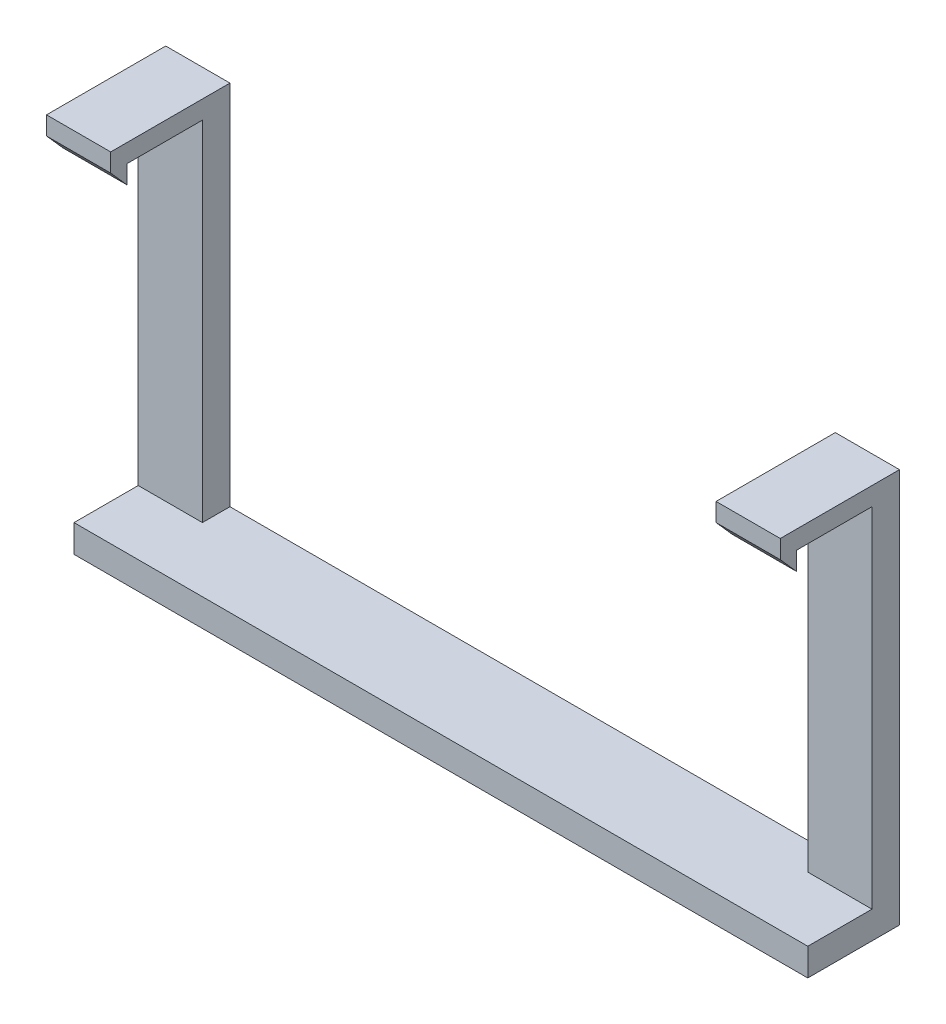
ISO-10303-21;
HEADER;
FILE_DESCRIPTION(('STEP AP214'),'2;1');
FILE_NAME('part.step','',(''),(''),'','','');
FILE_SCHEMA(('AUTOMOTIVE_DESIGN { 1 0 10303 214 1 1 1 1 }'));
ENDSEC;
DATA;
#1=APPLICATION_CONTEXT('core data for automotive mechanical design processes');
#2=APPLICATION_PROTOCOL_DEFINITION('international standard','automotive_design',2000,#1);
#3=PRODUCT_CONTEXT('',#1,'mechanical');
#4=PRODUCT('Part','Part','',(#3));
#5=PRODUCT_RELATED_PRODUCT_CATEGORY('part','',(#4));
#6=PRODUCT_DEFINITION_FORMATION('','',#4);
#7=PRODUCT_DEFINITION_CONTEXT('part definition',#1,'design');
#8=PRODUCT_DEFINITION('design','',#6,#7);
#9=PRODUCT_DEFINITION_SHAPE('','',#8);
#10=(LENGTH_UNIT() NAMED_UNIT(*) SI_UNIT(.MILLI.,.METRE.));
#11=(NAMED_UNIT(*) PLANE_ANGLE_UNIT() SI_UNIT($,.RADIAN.));
#12=(NAMED_UNIT(*) SI_UNIT($,.STERADIAN.) SOLID_ANGLE_UNIT());
#13=UNCERTAINTY_MEASURE_WITH_UNIT(LENGTH_MEASURE(1.E-05),#10,'distance_accuracy_value','');
#14=(GEOMETRIC_REPRESENTATION_CONTEXT(3) GLOBAL_UNCERTAINTY_ASSIGNED_CONTEXT((#13)) GLOBAL_UNIT_ASSIGNED_CONTEXT((#10,
#11,#12)) REPRESENTATION_CONTEXT('',''));
#15=CARTESIAN_POINT('',(0.,0.,0.));
#16=DIRECTION('',(0.,0.,1.));
#17=DIRECTION('',(1.,0.,0.));
#18=AXIS2_PLACEMENT_3D('',#15,#16,#17);
#19=CARTESIAN_POINT('',(0.,0.,13.));
#20=DIRECTION('',(0.,1.,0.));
#21=DIRECTION('',(0.,0.,1.));
#22=AXIS2_PLACEMENT_3D('',#19,#20,#21);
#23=PLANE('',#22);
#24=DIRECTION('',(1.,0.,0.));
#25=VECTOR('',#24,1.);
#26=CARTESIAN_POINT('',(-60.0000000000001,0.,10.));
#27=LINE('',#26,#25);
#28=CARTESIAN_POINT('',(-40.,0.,10.));
#29=VERTEX_POINT('',#28);
#30=CARTESIAN_POINT('',(40.,0.,10.));
#31=VERTEX_POINT('',#30);
#32=EDGE_CURVE('E181',#29,#31,#27,.T.);
#33=ORIENTED_EDGE('',*,*,#32,.F.);
#34=DIRECTION('',(0.,0.,-1.));
#35=VECTOR('',#34,1.);
#36=CARTESIAN_POINT('',(-40.,0.,13.));
#37=LINE('',#36,#35);
#38=CARTESIAN_POINT('',(-40.,0.,0.));
#39=VERTEX_POINT('',#38);
#40=EDGE_CURVE('E221',#29,#39,#37,.T.);
#41=ORIENTED_EDGE('',*,*,#40,.T.);
#42=DIRECTION('',(1.,0.,0.));
#43=VECTOR('',#42,1.);
#44=CARTESIAN_POINT('',(0.,0.,0.));
#45=LINE('',#44,#43);
#46=CARTESIAN_POINT('',(40.,0.,0.));
#47=VERTEX_POINT('',#46);
#48=EDGE_CURVE('E189',#39,#47,#45,.T.);
#49=ORIENTED_EDGE('',*,*,#48,.T.);
#50=DIRECTION('',(0.,0.,-1.));
#51=VECTOR('',#50,1.);
#52=CARTESIAN_POINT('',(40.,0.,13.));
#53=LINE('',#52,#51);
#54=EDGE_CURVE('E131',#31,#47,#53,.T.);
#55=ORIENTED_EDGE('',*,*,#54,.F.);
#56=EDGE_LOOP('',(#33,#41,#49,#55));
#57=FACE_BOUND('',#56,.T.);
#58=ADVANCED_FACE('F39',(#57),#23,.F.);
#59=CARTESIAN_POINT('',(40.,0.,13.));
#60=DIRECTION('',(-1.,0.,0.));
#61=DIRECTION('',(0.,0.,1.));
#62=AXIS2_PLACEMENT_3D('',#59,#60,#61);
#63=PLANE('',#62);
#64=DIRECTION('',(0.,-1.,0.));
#65=VECTOR('',#64,1.);
#66=CARTESIAN_POINT('',(40.,0.,10.));
#67=LINE('',#66,#65);
#68=CARTESIAN_POINT('',(40.,3.,10.));
#69=VERTEX_POINT('',#68);
#70=EDGE_CURVE('E216',#69,#31,#67,.T.);
#71=ORIENTED_EDGE('',*,*,#70,.T.);
#72=ORIENTED_EDGE('',*,*,#54,.T.);
#73=DIRECTION('',(0.,1.,0.));
#74=VECTOR('',#73,1.);
#75=CARTESIAN_POINT('',(40.,0.,0.));
#76=LINE('',#75,#74);
#77=CARTESIAN_POINT('',(40.,43.,0.));
#78=VERTEX_POINT('',#77);
#79=EDGE_CURVE('E198',#47,#78,#76,.T.);
#80=ORIENTED_EDGE('',*,*,#79,.T.);
#81=DIRECTION('',(0.,0.,-1.));
#82=VECTOR('',#81,1.);
#83=CARTESIAN_POINT('',(40.,43.,13.));
#84=LINE('',#83,#82);
#85=CARTESIAN_POINT('',(40.,43.,13.));
#86=VERTEX_POINT('',#85);
#87=EDGE_CURVE('E127',#86,#78,#84,.T.);
#88=ORIENTED_EDGE('',*,*,#87,.F.);
#89=DIRECTION('',(0.,1.,0.));
#90=VECTOR('',#89,1.);
#91=CARTESIAN_POINT('',(40.,0.,13.));
#92=LINE('',#91,#90);
#93=CARTESIAN_POINT('',(40.,41.,13.));
#94=VERTEX_POINT('',#93);
#95=EDGE_CURVE('E119',#94,#86,#92,.T.);
#96=ORIENTED_EDGE('',*,*,#95,.F.);
#97=DIRECTION('',(0.,0.748415259125279,0.663230427459749));
#98=VECTOR('',#97,1.);
#99=CARTESIAN_POINT('',(40.,11.5820255572943,-13.0696124601191));
#100=LINE('',#99,#98);
#101=CARTESIAN_POINT('',(40.,39.0020320624936,11.2294413254053));
#102=VERTEX_POINT('',#101);
#103=EDGE_CURVE('E54',#102,#94,#100,.T.);
#104=ORIENTED_EDGE('',*,*,#103,.F.);
#105=DIRECTION('',(0.,-1.,0.));
#106=VECTOR('',#105,1.);
#107=CARTESIAN_POINT('',(40.,0.,11.2294413254053));
#108=LINE('',#107,#106);
#109=CARTESIAN_POINT('',(40.,41.0020320624936,11.2294413254053));
#110=VERTEX_POINT('',#109);
#111=EDGE_CURVE('E250',#110,#102,#108,.T.);
#112=ORIENTED_EDGE('',*,*,#111,.F.);
#113=DIRECTION('',(0.,0.,-1.));
#114=VECTOR('',#113,1.);
#115=CARTESIAN_POINT('',(40.,41.0020320624936,0.));
#116=LINE('',#115,#114);
#117=CARTESIAN_POINT('',(40.,41.0020320624936,3.));
#118=VERTEX_POINT('',#117);
#119=EDGE_CURVE('E166',#110,#118,#116,.T.);
#120=ORIENTED_EDGE('',*,*,#119,.T.);
#121=DIRECTION('',(0.,-1.,0.));
#122=VECTOR('',#121,1.);
#123=CARTESIAN_POINT('',(40.,0.,2.99999999999999));
#124=LINE('',#123,#122);
#125=CARTESIAN_POINT('',(40.,3.,3.));
#126=VERTEX_POINT('',#125);
#127=EDGE_CURVE('E259',#118,#126,#124,.T.);
#128=ORIENTED_EDGE('',*,*,#127,.T.);
#129=DIRECTION('',(0.,0.,1.));
#130=VECTOR('',#129,1.);
#131=CARTESIAN_POINT('',(40.,3.,0.));
#132=LINE('',#131,#130);
#133=EDGE_CURVE('E257',#126,#69,#132,.T.);
#134=ORIENTED_EDGE('',*,*,#133,.T.);
#135=EDGE_LOOP('',(#71,#72,#80,#88,#96,#104,#112,#120,#128,#134));
#136=FACE_BOUND('',#135,.T.);
#137=ADVANCED_FACE('F210',(#136),#63,.F.);
#138=CARTESIAN_POINT('',(33.,3.,13.));
#139=DIRECTION('',(1.,0.,0.));
#140=DIRECTION('',(0.,0.,-1.));
#141=AXIS2_PLACEMENT_3D('',#138,#139,#140);
#142=PLANE('',#141);
#143=DIRECTION('',(0.,-1.,0.));
#144=VECTOR('',#143,1.);
#145=CARTESIAN_POINT('',(33.,3.,2.99999999999999));
#146=LINE('',#145,#144);
#147=CARTESIAN_POINT('',(33.,41.0020320624936,3.));
#148=VERTEX_POINT('',#147);
#149=CARTESIAN_POINT('',(33.,3.,3.));
#150=VERTEX_POINT('',#149);
#151=EDGE_CURVE('E173',#148,#150,#146,.T.);
#152=ORIENTED_EDGE('',*,*,#151,.F.);
#153=DIRECTION('',(0.,0.,-1.));
#154=VECTOR('',#153,1.);
#155=CARTESIAN_POINT('',(33.,41.0020320624936,13.));
#156=LINE('',#155,#154);
#157=CARTESIAN_POINT('',(33.,41.0020320624936,11.2294413254053));
#158=VERTEX_POINT('',#157);
#159=EDGE_CURVE('E11',#158,#148,#156,.T.);
#160=ORIENTED_EDGE('',*,*,#159,.F.);
#161=DIRECTION('',(0.,-1.,0.));
#162=VECTOR('',#161,1.);
#163=CARTESIAN_POINT('',(33.,3.,11.2294413254053));
#164=LINE('',#163,#162);
#165=CARTESIAN_POINT('',(33.,39.0020320624936,11.2294413254053));
#166=VERTEX_POINT('',#165);
#167=EDGE_CURVE('E47',#158,#166,#164,.T.);
#168=ORIENTED_EDGE('',*,*,#167,.T.);
#169=DIRECTION('',(0.,0.748415259125279,0.663230427459749));
#170=VECTOR('',#169,1.);
#171=CARTESIAN_POINT('',(33.,19.7152347965208,-5.86212734462819));
#172=LINE('',#171,#170);
#173=CARTESIAN_POINT('',(33.,41.,13.));
#174=VERTEX_POINT('',#173);
#175=EDGE_CURVE('E148',#166,#174,#172,.T.);
#176=ORIENTED_EDGE('',*,*,#175,.T.);
#177=DIRECTION('',(0.,-1.,0.));
#178=VECTOR('',#177,1.);
#179=CARTESIAN_POINT('',(33.,3.,13.));
#180=LINE('',#179,#178);
#181=CARTESIAN_POINT('',(33.,43.,13.));
#182=VERTEX_POINT('',#181);
#183=EDGE_CURVE('E100',#182,#174,#180,.T.);
#184=ORIENTED_EDGE('',*,*,#183,.F.);
#185=DIRECTION('',(0.,0.,-1.));
#186=VECTOR('',#185,1.);
#187=CARTESIAN_POINT('',(33.,43.,13.));
#188=LINE('',#187,#186);
#189=CARTESIAN_POINT('',(33.,43.,0.));
#190=VERTEX_POINT('',#189);
#191=EDGE_CURVE('E99',#182,#190,#188,.T.);
#192=ORIENTED_EDGE('',*,*,#191,.T.);
#193=DIRECTION('',(0.,-1.,0.));
#194=VECTOR('',#193,1.);
#195=CARTESIAN_POINT('',(33.,3.,0.));
#196=LINE('',#195,#194);
#197=CARTESIAN_POINT('',(33.,3.,0.));
#198=VERTEX_POINT('',#197);
#199=EDGE_CURVE('E104',#190,#198,#196,.T.);
#200=ORIENTED_EDGE('',*,*,#199,.T.);
#201=DIRECTION('',(0.,0.,-1.));
#202=VECTOR('',#201,1.);
#203=CARTESIAN_POINT('',(33.,3.,13.));
#204=LINE('',#203,#202);
#205=EDGE_CURVE('E83',#150,#198,#204,.T.);
#206=ORIENTED_EDGE('',*,*,#205,.F.);
#207=EDGE_LOOP('',(#152,#160,#168,#176,#184,#192,#200,#206));
#208=FACE_BOUND('',#207,.T.);
#209=ADVANCED_FACE('F105',(#208),#142,.F.);
#210=CARTESIAN_POINT('',(0.,3.,13.));
#211=DIRECTION('',(0.,-1.,0.));
#212=DIRECTION('',(0.,0.,-1.));
#213=AXIS2_PLACEMENT_3D('',#210,#211,#212);
#214=PLANE('',#213);
#215=DIRECTION('',(-1.,0.,0.));
#216=VECTOR('',#215,1.);
#217=CARTESIAN_POINT('',(0.,3.,10.));
#218=LINE('',#217,#216);
#219=CARTESIAN_POINT('',(-40.,3.,10.));
#220=VERTEX_POINT('',#219);
#221=EDGE_CURVE('E137',#69,#220,#218,.T.);
#222=ORIENTED_EDGE('',*,*,#221,.F.);
#223=ORIENTED_EDGE('',*,*,#133,.F.);
#224=DIRECTION('',(1.,0.,0.));
#225=VECTOR('',#224,1.);
#226=CARTESIAN_POINT('',(-60.0000000000001,3.,3.));
#227=LINE('',#226,#225);
#228=EDGE_CURVE('E95',#150,#126,#227,.T.);
#229=ORIENTED_EDGE('',*,*,#228,.F.);
#230=ORIENTED_EDGE('',*,*,#205,.T.);
#231=DIRECTION('',(-1.,0.,0.));
#232=VECTOR('',#231,1.);
#233=CARTESIAN_POINT('',(0.,3.,0.));
#234=LINE('',#233,#232);
#235=CARTESIAN_POINT('',(-33.,3.,0.));
#236=VERTEX_POINT('',#235);
#237=EDGE_CURVE('E90',#198,#236,#234,.T.);
#238=ORIENTED_EDGE('',*,*,#237,.T.);
#239=DIRECTION('',(0.,0.,-1.));
#240=VECTOR('',#239,1.);
#241=CARTESIAN_POINT('',(-33.,3.,13.));
#242=LINE('',#241,#240);
#243=CARTESIAN_POINT('',(-33.,3.,3.));
#244=VERTEX_POINT('',#243);
#245=EDGE_CURVE('E389',#244,#236,#242,.T.);
#246=ORIENTED_EDGE('',*,*,#245,.F.);
#247=DIRECTION('',(-1.,0.,0.));
#248=VECTOR('',#247,1.);
#249=CARTESIAN_POINT('',(60.0000000000001,3.,3.));
#250=LINE('',#249,#248);
#251=CARTESIAN_POINT('',(-40.,3.,3.));
#252=VERTEX_POINT('',#251);
#253=EDGE_CURVE('E335',#244,#252,#250,.T.);
#254=ORIENTED_EDGE('',*,*,#253,.T.);
#255=DIRECTION('',(0.,0.,1.));
#256=VECTOR('',#255,1.);
#257=CARTESIAN_POINT('',(-40.,3.,0.));
#258=LINE('',#257,#256);
#259=EDGE_CURVE('E354',#252,#220,#258,.T.);
#260=ORIENTED_EDGE('',*,*,#259,.T.);
#261=EDGE_LOOP('',(#222,#223,#229,#230,#238,#246,#254,#260));
#262=FACE_BOUND('',#261,.T.);
#263=ADVANCED_FACE('F86',(#262),#214,.F.);
#264=CARTESIAN_POINT('',(33.,43.,13.));
#265=DIRECTION('',(0.,-1.,0.));
#266=DIRECTION('',(0.,0.,-1.));
#267=AXIS2_PLACEMENT_3D('',#264,#265,#266);
#268=PLANE('',#267);
#269=DIRECTION('',(-1.,0.,0.));
#270=VECTOR('',#269,1.);
#271=CARTESIAN_POINT('',(33.,43.,0.));
#272=LINE('',#271,#270);
#273=EDGE_CURVE('E110',#78,#190,#272,.T.);
#274=ORIENTED_EDGE('',*,*,#273,.T.);
#275=ORIENTED_EDGE('',*,*,#191,.F.);
#276=DIRECTION('',(-1.,0.,0.));
#277=VECTOR('',#276,1.);
#278=CARTESIAN_POINT('',(33.,43.,13.));
#279=LINE('',#278,#277);
#280=EDGE_CURVE('E63',#86,#182,#279,.T.);
#281=ORIENTED_EDGE('',*,*,#280,.F.);
#282=ORIENTED_EDGE('',*,*,#87,.T.);
#283=EDGE_LOOP('',(#274,#275,#281,#282));
#284=FACE_BOUND('',#283,.T.);
#285=ADVANCED_FACE('F202',(#284),#268,.F.);
#286=CARTESIAN_POINT('',(0.,0.,13.));
#287=DIRECTION('',(0.,0.,-1.));
#288=DIRECTION('',(-1.,0.,0.));
#289=AXIS2_PLACEMENT_3D('',#286,#287,#288);
#290=PLANE('',#289);
#291=ORIENTED_EDGE('',*,*,#183,.T.);
#292=DIRECTION('',(1.,0.,0.));
#293=VECTOR('',#292,1.);
#294=CARTESIAN_POINT('',(0.,41.,13.));
#295=LINE('',#294,#293);
#296=EDGE_CURVE('E134',#174,#94,#295,.T.);
#297=ORIENTED_EDGE('',*,*,#296,.T.);
#298=ORIENTED_EDGE('',*,*,#95,.T.);
#299=ORIENTED_EDGE('',*,*,#280,.T.);
#300=EDGE_LOOP('',(#291,#297,#298,#299));
#301=FACE_BOUND('',#300,.T.);
#302=ADVANCED_FACE('F432',(#301),#290,.F.);
#303=CARTESIAN_POINT('',(0.,0.,0.));
#304=DIRECTION('',(0.,0.,-1.));
#305=DIRECTION('',(-1.,0.,0.));
#306=AXIS2_PLACEMENT_3D('',#303,#304,#305);
#307=PLANE('',#306);
#308=ORIENTED_EDGE('',*,*,#48,.F.);
#309=DIRECTION('',(0.,1.,0.));
#310=VECTOR('',#309,1.);
#311=CARTESIAN_POINT('',(-40.,0.,0.));
#312=LINE('',#311,#310);
#313=CARTESIAN_POINT('',(-40.,43.,0.));
#314=VERTEX_POINT('',#313);
#315=EDGE_CURVE('E378',#39,#314,#312,.T.);
#316=ORIENTED_EDGE('',*,*,#315,.T.);
#317=DIRECTION('',(1.,0.,0.));
#318=VECTOR('',#317,1.);
#319=CARTESIAN_POINT('',(-33.,43.,0.));
#320=LINE('',#319,#318);
#321=CARTESIAN_POINT('',(-33.,43.,0.));
#322=VERTEX_POINT('',#321);
#323=EDGE_CURVE('E392',#314,#322,#320,.T.);
#324=ORIENTED_EDGE('',*,*,#323,.T.);
#325=DIRECTION('',(0.,-1.,0.));
#326=VECTOR('',#325,1.);
#327=CARTESIAN_POINT('',(-33.,3.,0.));
#328=LINE('',#327,#326);
#329=EDGE_CURVE('E116',#322,#236,#328,.T.);
#330=ORIENTED_EDGE('',*,*,#329,.T.);
#331=ORIENTED_EDGE('',*,*,#237,.F.);
#332=ORIENTED_EDGE('',*,*,#199,.F.);
#333=ORIENTED_EDGE('',*,*,#273,.F.);
#334=ORIENTED_EDGE('',*,*,#79,.F.);
#335=EDGE_LOOP('',(#308,#316,#324,#330,#331,#332,#333,#334));
#336=FACE_BOUND('',#335,.T.);
#337=ADVANCED_FACE('F113',(#336),#307,.T.);
#338=CARTESIAN_POINT('',(-60.0000000000001,0.,11.2294413254053));
#339=DIRECTION('',(0.,0.,1.));
#340=DIRECTION('',(1.,0.,0.));
#341=AXIS2_PLACEMENT_3D('',#338,#339,#340);
#342=PLANE('',#341);
#343=DIRECTION('',(1.,0.,0.));
#344=VECTOR('',#343,1.);
#345=CARTESIAN_POINT('',(-60.0000000000001,41.0020320624936,11.2294413254053));
#346=LINE('',#345,#344);
#347=EDGE_CURVE('E157',#158,#110,#346,.T.);
#348=ORIENTED_EDGE('',*,*,#347,.T.);
#349=ORIENTED_EDGE('',*,*,#111,.T.);
#350=DIRECTION('',(1.,0.,0.));
#351=VECTOR('',#350,1.);
#352=CARTESIAN_POINT('',(-60.0000000000001,39.0020320624936,11.2294413254053));
#353=LINE('',#352,#351);
#354=EDGE_CURVE('E159',#166,#102,#353,.T.);
#355=ORIENTED_EDGE('',*,*,#354,.F.);
#356=ORIENTED_EDGE('',*,*,#167,.F.);
#357=EDGE_LOOP('',(#348,#349,#355,#356));
#358=FACE_BOUND('',#357,.T.);
#359=ADVANCED_FACE('F155',(#358),#342,.F.);
#360=CARTESIAN_POINT('',(-60.0000000000001,41.0020320624936,0.));
#361=DIRECTION('',(0.,-1.,0.));
#362=DIRECTION('',(0.,0.,-1.));
#363=AXIS2_PLACEMENT_3D('',#360,#361,#362);
#364=PLANE('',#363);
#365=ORIENTED_EDGE('',*,*,#159,.T.);
#366=DIRECTION('',(1.,0.,0.));
#367=VECTOR('',#366,1.);
#368=CARTESIAN_POINT('',(-60.0000000000001,41.0020320624936,3.));
#369=LINE('',#368,#367);
#370=EDGE_CURVE('E169',#148,#118,#369,.T.);
#371=ORIENTED_EDGE('',*,*,#370,.T.);
#372=ORIENTED_EDGE('',*,*,#119,.F.);
#373=ORIENTED_EDGE('',*,*,#347,.F.);
#374=EDGE_LOOP('',(#365,#371,#372,#373));
#375=FACE_BOUND('',#374,.T.);
#376=ADVANCED_FACE('F162',(#375),#364,.T.);
#377=CARTESIAN_POINT('',(-60.0000000000001,0.,2.99999999999999));
#378=DIRECTION('',(0.,0.,1.));
#379=DIRECTION('',(0.,-1.,0.));
#380=AXIS2_PLACEMENT_3D('',#377,#378,#379);
#381=PLANE('',#380);
#382=ORIENTED_EDGE('',*,*,#151,.T.);
#383=ORIENTED_EDGE('',*,*,#228,.T.);
#384=ORIENTED_EDGE('',*,*,#127,.F.);
#385=ORIENTED_EDGE('',*,*,#370,.F.);
#386=EDGE_LOOP('',(#382,#383,#384,#385));
#387=FACE_BOUND('',#386,.T.);
#388=ADVANCED_FACE('F275',(#387),#381,.T.);
#389=CARTESIAN_POINT('',(-60.0000000000001,0.,10.));
#390=DIRECTION('',(0.,0.,1.));
#391=DIRECTION('',(1.,0.,0.));
#392=AXIS2_PLACEMENT_3D('',#389,#390,#391);
#393=PLANE('',#392);
#394=ORIENTED_EDGE('',*,*,#221,.T.);
#395=DIRECTION('',(0.,-1.,0.));
#396=VECTOR('',#395,1.);
#397=CARTESIAN_POINT('',(-40.,0.,10.));
#398=LINE('',#397,#396);
#399=EDGE_CURVE('E344',#220,#29,#398,.T.);
#400=ORIENTED_EDGE('',*,*,#399,.T.);
#401=ORIENTED_EDGE('',*,*,#32,.T.);
#402=ORIENTED_EDGE('',*,*,#70,.F.);
#403=EDGE_LOOP('',(#394,#400,#401,#402));
#404=FACE_BOUND('',#403,.T.);
#405=ADVANCED_FACE('F412',(#404),#393,.T.);
#406=CARTESIAN_POINT('',(-60.0000000000001,11.5820255572943,-13.0696124601191));
#407=DIRECTION('',(0.,0.663230427459749,-0.748415259125279));
#408=DIRECTION('',(0.,0.748415259125279,0.663230427459749));
#409=AXIS2_PLACEMENT_3D('',#406,#407,#408);
#410=PLANE('',#409);
#411=ORIENTED_EDGE('',*,*,#354,.T.);
#412=ORIENTED_EDGE('',*,*,#103,.T.);
#413=ORIENTED_EDGE('',*,*,#296,.F.);
#414=ORIENTED_EDGE('',*,*,#175,.F.);
#415=EDGE_LOOP('',(#411,#412,#413,#414));
#416=FACE_BOUND('',#415,.T.);
#417=ADVANCED_FACE('F414',(#416),#410,.F.);
#418=CARTESIAN_POINT('',(-40.,0.,13.));
#419=DIRECTION('',(1.,0.,0.));
#420=DIRECTION('',(0.,0.,1.));
#421=AXIS2_PLACEMENT_3D('',#418,#419,#420);
#422=PLANE('',#421);
#423=ORIENTED_EDGE('',*,*,#399,.F.);
#424=ORIENTED_EDGE('',*,*,#259,.F.);
#425=DIRECTION('',(0.,-1.,0.));
#426=VECTOR('',#425,1.);
#427=CARTESIAN_POINT('',(-40.,0.,2.99999999999999));
#428=LINE('',#427,#426);
#429=CARTESIAN_POINT('',(-40.,41.0020320624936,3.));
#430=VERTEX_POINT('',#429);
#431=EDGE_CURVE('E357',#430,#252,#428,.T.);
#432=ORIENTED_EDGE('',*,*,#431,.F.);
#433=DIRECTION('',(0.,0.,-1.));
#434=VECTOR('',#433,1.);
#435=CARTESIAN_POINT('',(-40.,41.0020320624936,0.));
#436=LINE('',#435,#434);
#437=CARTESIAN_POINT('',(-40.,41.0020320624936,11.2294413254053));
#438=VERTEX_POINT('',#437);
#439=EDGE_CURVE('E336',#438,#430,#436,.T.);
#440=ORIENTED_EDGE('',*,*,#439,.F.);
#441=DIRECTION('',(0.,-1.,0.));
#442=VECTOR('',#441,1.);
#443=CARTESIAN_POINT('',(-40.,0.,11.2294413254053));
#444=LINE('',#443,#442);
#445=CARTESIAN_POINT('',(-40.,39.0020320624936,11.2294413254053));
#446=VERTEX_POINT('',#445);
#447=EDGE_CURVE('E328',#438,#446,#444,.T.);
#448=ORIENTED_EDGE('',*,*,#447,.T.);
#449=DIRECTION('',(0.,0.748415259125279,0.663230427459749));
#450=VECTOR('',#449,1.);
#451=CARTESIAN_POINT('',(-40.,11.5820255572943,-13.0696124601191));
#452=LINE('',#451,#450);
#453=CARTESIAN_POINT('',(-40.,41.,13.));
#454=VERTEX_POINT('',#453);
#455=EDGE_CURVE('E339',#446,#454,#452,.T.);
#456=ORIENTED_EDGE('',*,*,#455,.T.);
#457=DIRECTION('',(0.,1.,0.));
#458=VECTOR('',#457,1.);
#459=CARTESIAN_POINT('',(-40.,0.,13.));
#460=LINE('',#459,#458);
#461=CARTESIAN_POINT('',(-40.,43.,13.));
#462=VERTEX_POINT('',#461);
#463=EDGE_CURVE('E379',#454,#462,#460,.T.);
#464=ORIENTED_EDGE('',*,*,#463,.T.);
#465=DIRECTION('',(0.,0.,-1.));
#466=VECTOR('',#465,1.);
#467=CARTESIAN_POINT('',(-40.,43.,13.));
#468=LINE('',#467,#466);
#469=EDGE_CURVE('E231',#462,#314,#468,.T.);
#470=ORIENTED_EDGE('',*,*,#469,.T.);
#471=ORIENTED_EDGE('',*,*,#315,.F.);
#472=ORIENTED_EDGE('',*,*,#40,.F.);
#473=EDGE_LOOP('',(#423,#424,#432,#440,#448,#456,#464,#470,#471,#472));
#474=FACE_BOUND('',#473,.T.);
#475=ADVANCED_FACE('F346',(#474),#422,.F.);
#476=CARTESIAN_POINT('',(-33.,3.,13.));
#477=DIRECTION('',(-1.,0.,0.));
#478=DIRECTION('',(0.,0.,-1.));
#479=AXIS2_PLACEMENT_3D('',#476,#477,#478);
#480=PLANE('',#479);
#481=DIRECTION('',(0.,-1.,0.));
#482=VECTOR('',#481,1.);
#483=CARTESIAN_POINT('',(-33.,3.,2.99999999999999));
#484=LINE('',#483,#482);
#485=CARTESIAN_POINT('',(-33.,41.0020320624936,3.));
#486=VERTEX_POINT('',#485);
#487=EDGE_CURVE('E374',#486,#244,#484,.T.);
#488=ORIENTED_EDGE('',*,*,#487,.T.);
#489=ORIENTED_EDGE('',*,*,#245,.T.);
#490=ORIENTED_EDGE('',*,*,#329,.F.);
#491=DIRECTION('',(0.,0.,-1.));
#492=VECTOR('',#491,1.);
#493=CARTESIAN_POINT('',(-33.,43.,13.));
#494=LINE('',#493,#492);
#495=CARTESIAN_POINT('',(-33.,43.,13.));
#496=VERTEX_POINT('',#495);
#497=EDGE_CURVE('E239',#496,#322,#494,.T.);
#498=ORIENTED_EDGE('',*,*,#497,.F.);
#499=DIRECTION('',(0.,-1.,0.));
#500=VECTOR('',#499,1.);
#501=CARTESIAN_POINT('',(-33.,3.,13.));
#502=LINE('',#501,#500);
#503=CARTESIAN_POINT('',(-33.,41.,13.));
#504=VERTEX_POINT('',#503);
#505=EDGE_CURVE('E385',#496,#504,#502,.T.);
#506=ORIENTED_EDGE('',*,*,#505,.T.);
#507=DIRECTION('',(0.,0.748415259125279,0.663230427459749));
#508=VECTOR('',#507,1.);
#509=CARTESIAN_POINT('',(-33.,19.7152347965208,-5.86212734462819));
#510=LINE('',#509,#508);
#511=CARTESIAN_POINT('',(-33.,39.0020320624936,11.2294413254053));
#512=VERTEX_POINT('',#511);
#513=EDGE_CURVE('E366',#512,#504,#510,.T.);
#514=ORIENTED_EDGE('',*,*,#513,.F.);
#515=DIRECTION('',(0.,-1.,0.));
#516=VECTOR('',#515,1.);
#517=CARTESIAN_POINT('',(-33.,3.,11.2294413254053));
#518=LINE('',#517,#516);
#519=CARTESIAN_POINT('',(-33.,41.0020320624936,11.2294413254053));
#520=VERTEX_POINT('',#519);
#521=EDGE_CURVE('E236',#520,#512,#518,.T.);
#522=ORIENTED_EDGE('',*,*,#521,.F.);
#523=DIRECTION('',(0.,0.,-1.));
#524=VECTOR('',#523,1.);
#525=CARTESIAN_POINT('',(-33.,41.0020320624936,13.));
#526=LINE('',#525,#524);
#527=EDGE_CURVE('E246',#520,#486,#526,.T.);
#528=ORIENTED_EDGE('',*,*,#527,.T.);
#529=EDGE_LOOP('',(#488,#489,#490,#498,#506,#514,#522,#528));
#530=FACE_BOUND('',#529,.T.);
#531=ADVANCED_FACE('F406',(#530),#480,.F.);
#532=CARTESIAN_POINT('',(-33.,43.,13.));
#533=DIRECTION('',(0.,-1.,0.));
#534=DIRECTION('',(0.,0.,-1.));
#535=AXIS2_PLACEMENT_3D('',#532,#533,#534);
#536=PLANE('',#535);
#537=ORIENTED_EDGE('',*,*,#323,.F.);
#538=ORIENTED_EDGE('',*,*,#469,.F.);
#539=DIRECTION('',(1.,0.,0.));
#540=VECTOR('',#539,1.);
#541=CARTESIAN_POINT('',(-33.,43.,13.));
#542=LINE('',#541,#540);
#543=EDGE_CURVE('E382',#462,#496,#542,.T.);
#544=ORIENTED_EDGE('',*,*,#543,.T.);
#545=ORIENTED_EDGE('',*,*,#497,.T.);
#546=EDGE_LOOP('',(#537,#538,#544,#545));
#547=FACE_BOUND('',#546,.T.);
#548=ADVANCED_FACE('F402',(#547),#536,.F.);
#549=CARTESIAN_POINT('',(0.,0.,13.));
#550=DIRECTION('',(0.,0.,-1.));
#551=DIRECTION('',(1.,0.,0.));
#552=AXIS2_PLACEMENT_3D('',#549,#550,#551);
#553=PLANE('',#552);
#554=ORIENTED_EDGE('',*,*,#505,.F.);
#555=ORIENTED_EDGE('',*,*,#543,.F.);
#556=ORIENTED_EDGE('',*,*,#463,.F.);
#557=DIRECTION('',(-1.,0.,0.));
#558=VECTOR('',#557,1.);
#559=CARTESIAN_POINT('',(0.,41.,13.));
#560=LINE('',#559,#558);
#561=EDGE_CURVE('E230',#504,#454,#560,.T.);
#562=ORIENTED_EDGE('',*,*,#561,.F.);
#563=EDGE_LOOP('',(#554,#555,#556,#562));
#564=FACE_BOUND('',#563,.T.);
#565=ADVANCED_FACE('F452',(#564),#553,.F.);
#566=CARTESIAN_POINT('',(60.0000000000001,0.,11.2294413254053));
#567=DIRECTION('',(0.,0.,1.));
#568=DIRECTION('',(-1.,0.,0.));
#569=AXIS2_PLACEMENT_3D('',#566,#567,#568);
#570=PLANE('',#569);
#571=DIRECTION('',(-1.,0.,0.));
#572=VECTOR('',#571,1.);
#573=CARTESIAN_POINT('',(60.0000000000001,41.0020320624936,11.2294413254053));
#574=LINE('',#573,#572);
#575=EDGE_CURVE('E363',#520,#438,#574,.T.);
#576=ORIENTED_EDGE('',*,*,#575,.F.);
#577=ORIENTED_EDGE('',*,*,#521,.T.);
#578=DIRECTION('',(-1.,0.,0.));
#579=VECTOR('',#578,1.);
#580=CARTESIAN_POINT('',(60.0000000000001,39.0020320624936,11.2294413254053));
#581=LINE('',#580,#579);
#582=EDGE_CURVE('E324',#512,#446,#581,.T.);
#583=ORIENTED_EDGE('',*,*,#582,.T.);
#584=ORIENTED_EDGE('',*,*,#447,.F.);
#585=EDGE_LOOP('',(#576,#577,#583,#584));
#586=FACE_BOUND('',#585,.T.);
#587=ADVANCED_FACE('F326',(#586),#570,.F.);
#588=CARTESIAN_POINT('',(60.0000000000001,41.0020320624936,0.));
#589=DIRECTION('',(0.,-1.,0.));
#590=DIRECTION('',(0.,0.,-1.));
#591=AXIS2_PLACEMENT_3D('',#588,#589,#590);
#592=PLANE('',#591);
#593=ORIENTED_EDGE('',*,*,#527,.F.);
#594=ORIENTED_EDGE('',*,*,#575,.T.);
#595=ORIENTED_EDGE('',*,*,#439,.T.);
#596=DIRECTION('',(-1.,0.,0.));
#597=VECTOR('',#596,1.);
#598=CARTESIAN_POINT('',(60.0000000000001,41.0020320624936,3.));
#599=LINE('',#598,#597);
#600=EDGE_CURVE('E367',#486,#430,#599,.T.);
#601=ORIENTED_EDGE('',*,*,#600,.F.);
#602=EDGE_LOOP('',(#593,#594,#595,#601));
#603=FACE_BOUND('',#602,.T.);
#604=ADVANCED_FACE('F460',(#603),#592,.T.);
#605=CARTESIAN_POINT('',(60.0000000000001,0.,2.99999999999999));
#606=DIRECTION('',(0.,0.,1.));
#607=DIRECTION('',(0.,-1.,0.));
#608=AXIS2_PLACEMENT_3D('',#605,#606,#607);
#609=PLANE('',#608);
#610=ORIENTED_EDGE('',*,*,#487,.F.);
#611=ORIENTED_EDGE('',*,*,#600,.T.);
#612=ORIENTED_EDGE('',*,*,#431,.T.);
#613=ORIENTED_EDGE('',*,*,#253,.F.);
#614=EDGE_LOOP('',(#610,#611,#612,#613));
#615=FACE_BOUND('',#614,.T.);
#616=ADVANCED_FACE('F410',(#615),#609,.T.);
#617=CARTESIAN_POINT('',(60.0000000000001,11.5820255572943,-13.0696124601191));
#618=DIRECTION('',(0.,0.663230427459749,-0.748415259125279));
#619=DIRECTION('',(0.,0.748415259125279,0.663230427459749));
#620=AXIS2_PLACEMENT_3D('',#617,#618,#619);
#621=PLANE('',#620);
#622=ORIENTED_EDGE('',*,*,#582,.F.);
#623=ORIENTED_EDGE('',*,*,#513,.T.);
#624=ORIENTED_EDGE('',*,*,#561,.T.);
#625=ORIENTED_EDGE('',*,*,#455,.F.);
#626=EDGE_LOOP('',(#622,#623,#624,#625));
#627=FACE_BOUND('',#626,.T.);
#628=ADVANCED_FACE('F340',(#627),#621,.F.);
#629=CLOSED_SHELL('',(#58,#137,#209,#263,#285,#302,#337,#359,#376,#388,#405,#417,#475,#531,#548,
#565,#587,#604,#616,#628));
#630=MANIFOLD_SOLID_BREP('B2',#629);
#631=ADVANCED_BREP_SHAPE_REPRESENTATION('',(#18,#630),#14);
#632=SHAPE_DEFINITION_REPRESENTATION(#9,#631);
ENDSEC;
END-ISO-10303-21;
